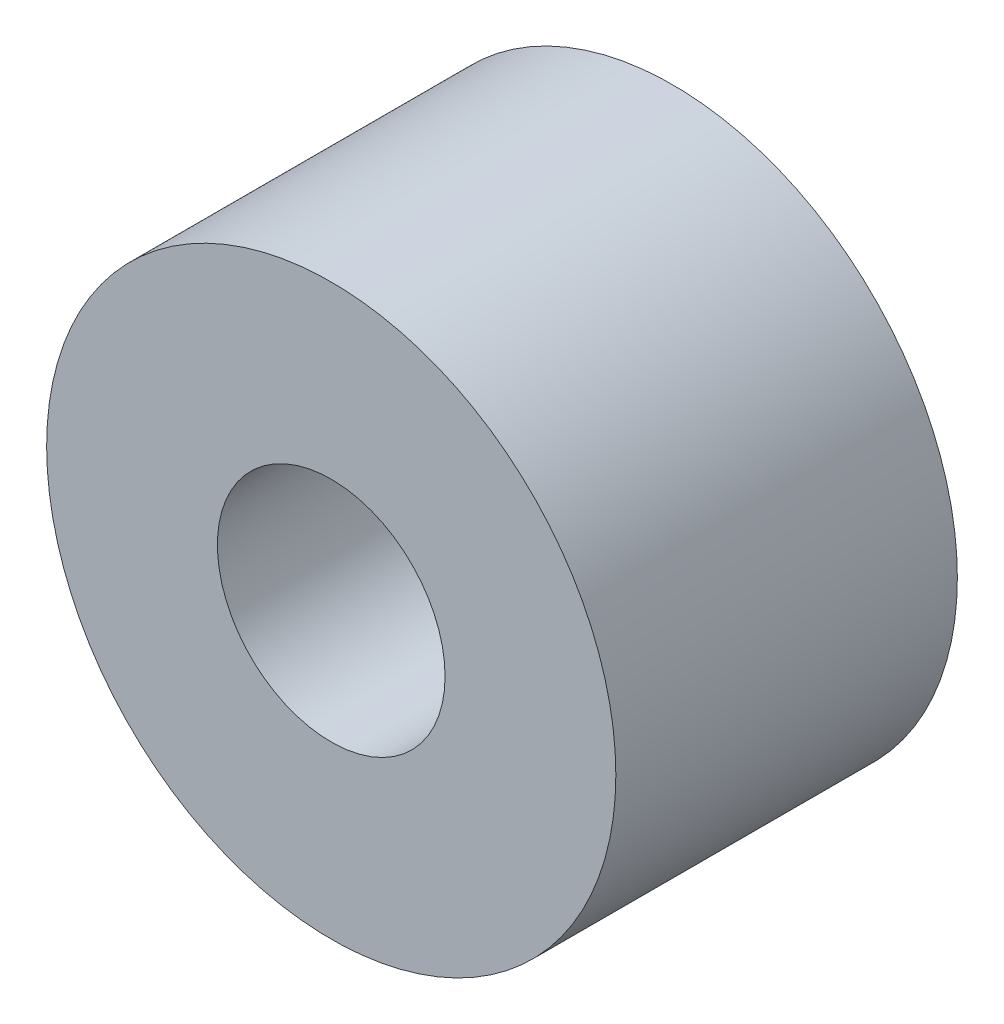
ISO-10303-21;
HEADER;
FILE_DESCRIPTION(('STEP AP214'),'2;1');
FILE_NAME('part.step','',(''),(''),'','','');
FILE_SCHEMA(('AUTOMOTIVE_DESIGN { 1 0 10303 214 1 1 1 1 }'));
ENDSEC;
DATA;
#1=APPLICATION_CONTEXT('core data for automotive mechanical design processes');
#2=APPLICATION_PROTOCOL_DEFINITION('international standard','automotive_design',2000,#1);
#3=PRODUCT_CONTEXT('',#1,'mechanical');
#4=PRODUCT('Part','Part','',(#3));
#5=PRODUCT_RELATED_PRODUCT_CATEGORY('part','',(#4));
#6=PRODUCT_DEFINITION_FORMATION('','',#4);
#7=PRODUCT_DEFINITION_CONTEXT('part definition',#1,'design');
#8=PRODUCT_DEFINITION('design','',#6,#7);
#9=PRODUCT_DEFINITION_SHAPE('','',#8);
#10=(LENGTH_UNIT() NAMED_UNIT(*) SI_UNIT(.MILLI.,.METRE.));
#11=(NAMED_UNIT(*) PLANE_ANGLE_UNIT() SI_UNIT($,.RADIAN.));
#12=(NAMED_UNIT(*) SI_UNIT($,.STERADIAN.) SOLID_ANGLE_UNIT());
#13=UNCERTAINTY_MEASURE_WITH_UNIT(LENGTH_MEASURE(1.E-05),#10,'distance_accuracy_value','');
#14=(GEOMETRIC_REPRESENTATION_CONTEXT(3) GLOBAL_UNCERTAINTY_ASSIGNED_CONTEXT((#13)) GLOBAL_UNIT_ASSIGNED_CONTEXT((#10,
#11,#12)) REPRESENTATION_CONTEXT('',''));
#15=CARTESIAN_POINT('',(0.,0.,0.));
#16=DIRECTION('',(0.,0.,1.));
#17=DIRECTION('',(1.,0.,0.));
#18=AXIS2_PLACEMENT_3D('',#15,#16,#17);
#19=CARTESIAN_POINT('',(0.,0.,3.));
#20=DIRECTION('',(0.,0.,1.));
#21=DIRECTION('',(1.,0.,0.));
#22=AXIS2_PLACEMENT_3D('',#19,#20,#21);
#23=PLANE('',#22);
#24=CARTESIAN_POINT('',(0.,0.,3.));
#25=DIRECTION('',(0.,0.,1.));
#26=DIRECTION('',(1.,0.,0.));
#27=AXIS2_PLACEMENT_3D('',#24,#25,#26);
#28=CIRCLE('',#27,2.5);
#29=CARTESIAN_POINT('',(2.5,0.,3.));
#30=VERTEX_POINT('',#29);
#31=EDGE_CURVE('E10',#30,#30,#28,.T.);
#32=ORIENTED_EDGE('',*,*,#31,.T.);
#33=EDGE_LOOP('',(#32));
#34=FACE_BOUND('',#33,.T.);
#35=CARTESIAN_POINT('',(0.,0.,3.));
#36=DIRECTION('',(0.,0.,1.));
#37=DIRECTION('',(1.,0.,0.));
#38=AXIS2_PLACEMENT_3D('',#35,#36,#37);
#39=CIRCLE('',#38,1.);
#40=CARTESIAN_POINT('',(1.,0.,3.));
#41=VERTEX_POINT('',#40);
#42=EDGE_CURVE('E41',#41,#41,#39,.T.);
#43=ORIENTED_EDGE('',*,*,#42,.F.);
#44=EDGE_LOOP('',(#43));
#45=FACE_BOUND('',#44,.T.);
#46=ADVANCED_FACE('F30',(#34,#45),#23,.T.);
#47=CARTESIAN_POINT('',(0.,0.,0.));
#48=DIRECTION('',(0.,0.,1.));
#49=DIRECTION('',(1.,0.,0.));
#50=AXIS2_PLACEMENT_3D('',#47,#48,#49);
#51=PLANE('',#50);
#52=CARTESIAN_POINT('',(0.,0.,0.));
#53=DIRECTION('',(0.,0.,1.));
#54=DIRECTION('',(1.,0.,0.));
#55=AXIS2_PLACEMENT_3D('',#52,#53,#54);
#56=CIRCLE('',#55,2.5);
#57=CARTESIAN_POINT('',(2.5,0.,0.));
#58=VERTEX_POINT('',#57);
#59=EDGE_CURVE('E34',#58,#58,#56,.T.);
#60=ORIENTED_EDGE('',*,*,#59,.F.);
#61=EDGE_LOOP('',(#60));
#62=FACE_BOUND('',#61,.T.);
#63=CARTESIAN_POINT('',(0.,0.,0.));
#64=DIRECTION('',(0.,0.,1.));
#65=DIRECTION('',(1.,0.,0.));
#66=AXIS2_PLACEMENT_3D('',#63,#64,#65);
#67=CIRCLE('',#66,1.);
#68=CARTESIAN_POINT('',(1.,0.,0.));
#69=VERTEX_POINT('',#68);
#70=EDGE_CURVE('E43',#69,#69,#67,.T.);
#71=ORIENTED_EDGE('',*,*,#70,.T.);
#72=EDGE_LOOP('',(#71));
#73=FACE_BOUND('',#72,.T.);
#74=ADVANCED_FACE('F53',(#62,#73),#51,.F.);
#75=CARTESIAN_POINT('',(0.,0.,3.));
#76=DIRECTION('',(0.,0.,-1.));
#77=DIRECTION('',(-1.,0.,0.));
#78=AXIS2_PLACEMENT_3D('',#75,#76,#77);
#79=CYLINDRICAL_SURFACE('',#78,2.5);
#80=ORIENTED_EDGE('',*,*,#31,.F.);
#81=EDGE_LOOP('',(#80));
#82=FACE_BOUND('',#81,.T.);
#83=ORIENTED_EDGE('',*,*,#59,.T.);
#84=EDGE_LOOP('',(#83));
#85=FACE_BOUND('',#84,.T.);
#86=ADVANCED_FACE('F32',(#82,#85),#79,.T.);
#87=CARTESIAN_POINT('',(0.,0.,3.));
#88=DIRECTION('',(0.,0.,-1.));
#89=DIRECTION('',(-1.,0.,0.));
#90=AXIS2_PLACEMENT_3D('',#87,#88,#89);
#91=CYLINDRICAL_SURFACE('',#90,1.);
#92=ORIENTED_EDGE('',*,*,#42,.T.);
#93=EDGE_LOOP('',(#92));
#94=FACE_BOUND('',#93,.T.);
#95=ORIENTED_EDGE('',*,*,#70,.F.);
#96=EDGE_LOOP('',(#95));
#97=FACE_BOUND('',#96,.T.);
#98=ADVANCED_FACE('F49',(#94,#97),#91,.F.);
#99=CLOSED_SHELL('',(#46,#74,#86,#98));
#100=MANIFOLD_SOLID_BREP('B2',#99);
#101=ADVANCED_BREP_SHAPE_REPRESENTATION('',(#18,#100),#14);
#102=SHAPE_DEFINITION_REPRESENTATION(#9,#101);
ENDSEC;
END-ISO-10303-21;
